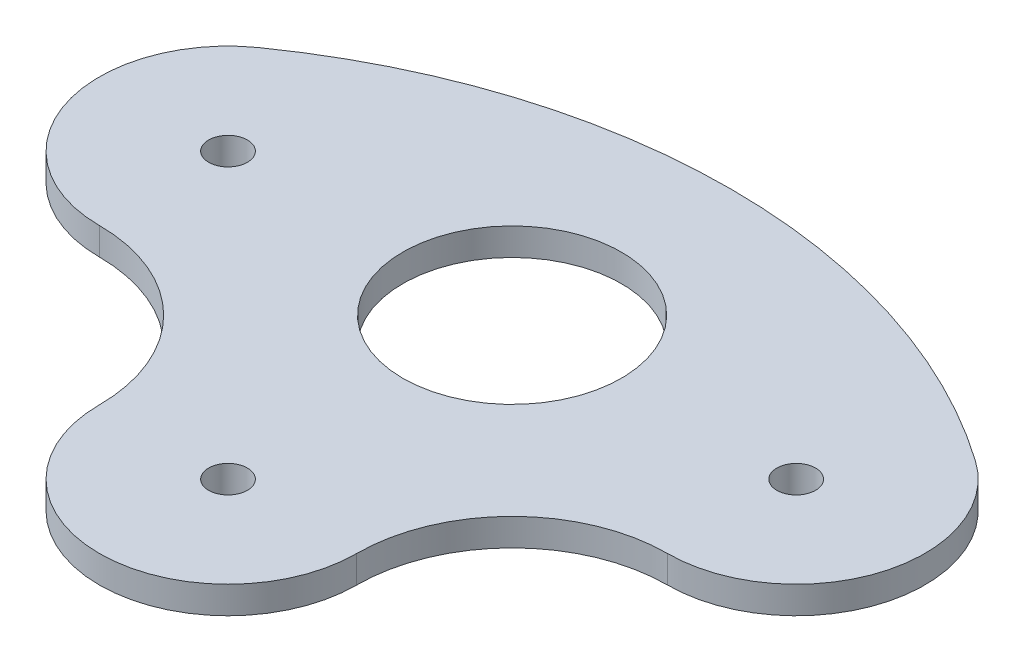
ISO-10303-21;
HEADER;
FILE_DESCRIPTION(('STEP AP214'),'2;1');
FILE_NAME('part.step','',(''),(''),'','','');
FILE_SCHEMA(('AUTOMOTIVE_DESIGN { 1 0 10303 214 1 1 1 1 }'));
ENDSEC;
DATA;
#1=APPLICATION_CONTEXT('core data for automotive mechanical design processes');
#2=APPLICATION_PROTOCOL_DEFINITION('international standard','automotive_design',2000,#1);
#3=PRODUCT_CONTEXT('',#1,'mechanical');
#4=PRODUCT('Part','Part','',(#3));
#5=PRODUCT_RELATED_PRODUCT_CATEGORY('part','',(#4));
#6=PRODUCT_DEFINITION_FORMATION('','',#4);
#7=PRODUCT_DEFINITION_CONTEXT('part definition',#1,'design');
#8=PRODUCT_DEFINITION('design','',#6,#7);
#9=PRODUCT_DEFINITION_SHAPE('','',#8);
#10=(LENGTH_UNIT() NAMED_UNIT(*) SI_UNIT(.MILLI.,.METRE.));
#11=(NAMED_UNIT(*) PLANE_ANGLE_UNIT() SI_UNIT($,.RADIAN.));
#12=(NAMED_UNIT(*) SI_UNIT($,.STERADIAN.) SOLID_ANGLE_UNIT());
#13=UNCERTAINTY_MEASURE_WITH_UNIT(LENGTH_MEASURE(1.E-05),#10,'distance_accuracy_value','');
#14=(GEOMETRIC_REPRESENTATION_CONTEXT(3) GLOBAL_UNCERTAINTY_ASSIGNED_CONTEXT((#13)) GLOBAL_UNIT_ASSIGNED_CONTEXT((#10,
#11,#12)) REPRESENTATION_CONTEXT('',''));
#15=CARTESIAN_POINT('',(0.,0.,0.));
#16=DIRECTION('',(0.,0.,1.));
#17=DIRECTION('',(1.,0.,0.));
#18=AXIS2_PLACEMENT_3D('',#15,#16,#17);
#19=CARTESIAN_POINT('',(16.5,3.175,23.4401315789474));
#20=DIRECTION('',(0.,-1.,0.));
#21=DIRECTION('',(0.,0.,-1.));
#22=AXIS2_PLACEMENT_3D('',#19,#20,#21);
#23=PLANE('',#22);
#24=CARTESIAN_POINT('',(0.,3.175,46.8802631578948));
#25=DIRECTION('',(0.,1.,0.));
#26=DIRECTION('',(0.,0.,-1.));
#27=AXIS2_PLACEMENT_3D('',#24,#25,#26);
#28=CIRCLE('',#27,72.2802631578949);
#29=CARTESIAN_POINT('',(41.6054026760919,3.175,-12.2249558192376));
#30=VERTEX_POINT('',#29);
#31=CARTESIAN_POINT('',(-41.6054026760919,3.175,-12.2249558192376));
#32=VERTEX_POINT('',#31);
#33=EDGE_CURVE('E129',#30,#32,#28,.T.);
#34=ORIENTED_EDGE('',*,*,#33,.T.);
#35=CARTESIAN_POINT('',(-33.,3.175,0.));
#36=DIRECTION('',(0.,1.,0.));
#37=DIRECTION('',(0.,0.,1.));
#38=AXIS2_PLACEMENT_3D('',#35,#36,#37);
#39=CIRCLE('',#38,14.95);
#40=CARTESIAN_POINT('',(-33.,3.175,14.95));
#41=VERTEX_POINT('',#40);
#42=EDGE_CURVE('E87',#32,#41,#39,.T.);
#43=ORIENTED_EDGE('',*,*,#42,.T.);
#44=CARTESIAN_POINT('',(-33.,3.175,33.));
#45=DIRECTION('',(0.,-1.,0.));
#46=DIRECTION('',(0.,0.,-1.));
#47=AXIS2_PLACEMENT_3D('',#44,#45,#46);
#48=CIRCLE('',#47,18.05);
#49=CARTESIAN_POINT('',(-14.95,3.175,33.));
#50=VERTEX_POINT('',#49);
#51=EDGE_CURVE('E100',#41,#50,#48,.T.);
#52=ORIENTED_EDGE('',*,*,#51,.T.);
#53=CARTESIAN_POINT('',(0.,3.175,33.));
#54=DIRECTION('',(0.,1.,0.));
#55=DIRECTION('',(0.,0.,1.));
#56=AXIS2_PLACEMENT_3D('',#53,#54,#55);
#57=CIRCLE('',#56,14.95);
#58=CARTESIAN_POINT('',(14.95,3.175,33.));
#59=VERTEX_POINT('',#58);
#60=EDGE_CURVE('E94',#50,#59,#57,.T.);
#61=ORIENTED_EDGE('',*,*,#60,.T.);
#62=CARTESIAN_POINT('',(33.,3.175,33.));
#63=DIRECTION('',(0.,-1.,0.));
#64=DIRECTION('',(0.,0.,-1.));
#65=AXIS2_PLACEMENT_3D('',#62,#63,#64);
#66=CIRCLE('',#65,18.05);
#67=CARTESIAN_POINT('',(33.,3.175,14.95));
#68=VERTEX_POINT('',#67);
#69=EDGE_CURVE('E98',#59,#68,#66,.T.);
#70=ORIENTED_EDGE('',*,*,#69,.T.);
#71=CARTESIAN_POINT('',(33.,3.175,0.));
#72=DIRECTION('',(0.,1.,0.));
#73=DIRECTION('',(0.,0.,1.));
#74=AXIS2_PLACEMENT_3D('',#71,#72,#73);
#75=CIRCLE('',#74,14.95);
#76=EDGE_CURVE('E50',#68,#30,#75,.T.);
#77=ORIENTED_EDGE('',*,*,#76,.T.);
#78=EDGE_LOOP('',(#34,#43,#52,#61,#70,#77));
#79=FACE_BOUND('',#78,.T.);
#80=CARTESIAN_POINT('',(0.,3.175,0.));
#81=DIRECTION('',(0.,1.,0.));
#82=DIRECTION('',(0.,0.,1.));
#83=AXIS2_PLACEMENT_3D('',#80,#81,#82);
#84=CIRCLE('',#83,12.7);
#85=CARTESIAN_POINT('',(0.,3.175,12.7));
#86=VERTEX_POINT('',#85);
#87=EDGE_CURVE('E122',#86,#86,#84,.T.);
#88=ORIENTED_EDGE('',*,*,#87,.F.);
#89=EDGE_LOOP('',(#88));
#90=FACE_BOUND('',#89,.T.);
#91=CARTESIAN_POINT('',(-33.,3.175,0.));
#92=DIRECTION('',(0.,1.,0.));
#93=DIRECTION('',(0.,0.,1.));
#94=AXIS2_PLACEMENT_3D('',#91,#92,#93);
#95=CIRCLE('',#94,2.25000000000001);
#96=CARTESIAN_POINT('',(-33.,3.175,2.25000000000001));
#97=VERTEX_POINT('',#96);
#98=EDGE_CURVE('E193',#97,#97,#95,.T.);
#99=ORIENTED_EDGE('',*,*,#98,.F.);
#100=EDGE_LOOP('',(#99));
#101=FACE_BOUND('',#100,.T.);
#102=CARTESIAN_POINT('',(33.,3.175,0.));
#103=DIRECTION('',(0.,1.,0.));
#104=DIRECTION('',(0.,0.,1.));
#105=AXIS2_PLACEMENT_3D('',#102,#103,#104);
#106=CIRCLE('',#105,2.25000000000001);
#107=CARTESIAN_POINT('',(33.,3.175,2.25000000000001));
#108=VERTEX_POINT('',#107);
#109=EDGE_CURVE('E187',#108,#108,#106,.T.);
#110=ORIENTED_EDGE('',*,*,#109,.F.);
#111=EDGE_LOOP('',(#110));
#112=FACE_BOUND('',#111,.T.);
#113=CARTESIAN_POINT('',(0.,3.175,33.));
#114=DIRECTION('',(0.,1.,0.));
#115=DIRECTION('',(0.,0.,1.));
#116=AXIS2_PLACEMENT_3D('',#113,#114,#115);
#117=CIRCLE('',#116,2.24999999999999);
#118=CARTESIAN_POINT('',(0.,3.175,35.25));
#119=VERTEX_POINT('',#118);
#120=EDGE_CURVE('E178',#119,#119,#117,.T.);
#121=ORIENTED_EDGE('',*,*,#120,.F.);
#122=EDGE_LOOP('',(#121));
#123=FACE_BOUND('',#122,.T.);
#124=ADVANCED_FACE('F33',(#79,#90,#101,#112,#123),#23,.F.);
#125=CARTESIAN_POINT('',(16.5,0.,23.4401315789474));
#126=DIRECTION('',(0.,-1.,0.));
#127=DIRECTION('',(0.,0.,-1.));
#128=AXIS2_PLACEMENT_3D('',#125,#126,#127);
#129=PLANE('',#128);
#130=CARTESIAN_POINT('',(33.,0.,0.));
#131=DIRECTION('',(0.,1.,0.));
#132=DIRECTION('',(0.,0.,1.));
#133=AXIS2_PLACEMENT_3D('',#130,#131,#132);
#134=CIRCLE('',#133,2.25000000000001);
#135=CARTESIAN_POINT('',(33.,0.,2.25000000000001));
#136=VERTEX_POINT('',#135);
#137=EDGE_CURVE('E184',#136,#136,#134,.T.);
#138=ORIENTED_EDGE('',*,*,#137,.T.);
#139=EDGE_LOOP('',(#138));
#140=FACE_BOUND('',#139,.T.);
#141=CARTESIAN_POINT('',(0.,0.,0.));
#142=DIRECTION('',(0.,1.,0.));
#143=DIRECTION('',(0.,0.,1.));
#144=AXIS2_PLACEMENT_3D('',#141,#142,#143);
#145=CIRCLE('',#144,12.7);
#146=CARTESIAN_POINT('',(0.,0.,12.7));
#147=VERTEX_POINT('',#146);
#148=EDGE_CURVE('E196',#147,#147,#145,.T.);
#149=ORIENTED_EDGE('',*,*,#148,.T.);
#150=EDGE_LOOP('',(#149));
#151=FACE_BOUND('',#150,.T.);
#152=CARTESIAN_POINT('',(0.,0.,46.8802631578948));
#153=DIRECTION('',(0.,1.,0.));
#154=DIRECTION('',(0.,0.,-1.));
#155=AXIS2_PLACEMENT_3D('',#152,#153,#154);
#156=CIRCLE('',#155,72.2802631578949);
#157=CARTESIAN_POINT('',(41.6054026760919,0.,-12.2249558192376));
#158=VERTEX_POINT('',#157);
#159=CARTESIAN_POINT('',(-41.6054026760919,0.,-12.2249558192376));
#160=VERTEX_POINT('',#159);
#161=EDGE_CURVE('E118',#158,#160,#156,.T.);
#162=ORIENTED_EDGE('',*,*,#161,.F.);
#163=CARTESIAN_POINT('',(33.,0.,0.));
#164=DIRECTION('',(0.,1.,0.));
#165=DIRECTION('',(0.,0.,1.));
#166=AXIS2_PLACEMENT_3D('',#163,#164,#165);
#167=CIRCLE('',#166,14.95);
#168=CARTESIAN_POINT('',(33.,0.,14.95));
#169=VERTEX_POINT('',#168);
#170=EDGE_CURVE('E79',#169,#158,#167,.T.);
#171=ORIENTED_EDGE('',*,*,#170,.F.);
#172=CARTESIAN_POINT('',(33.,0.,33.));
#173=DIRECTION('',(0.,-1.,0.));
#174=DIRECTION('',(0.,0.,-1.));
#175=AXIS2_PLACEMENT_3D('',#172,#173,#174);
#176=CIRCLE('',#175,18.05);
#177=CARTESIAN_POINT('',(14.95,0.,33.));
#178=VERTEX_POINT('',#177);
#179=EDGE_CURVE('E73',#178,#169,#176,.T.);
#180=ORIENTED_EDGE('',*,*,#179,.F.);
#181=CARTESIAN_POINT('',(0.,0.,33.));
#182=DIRECTION('',(0.,1.,0.));
#183=DIRECTION('',(0.,0.,1.));
#184=AXIS2_PLACEMENT_3D('',#181,#182,#183);
#185=CIRCLE('',#184,14.95);
#186=CARTESIAN_POINT('',(-14.95,0.,33.));
#187=VERTEX_POINT('',#186);
#188=EDGE_CURVE('E108',#187,#178,#185,.T.);
#189=ORIENTED_EDGE('',*,*,#188,.F.);
#190=CARTESIAN_POINT('',(-33.,0.,33.));
#191=DIRECTION('',(0.,-1.,0.));
#192=DIRECTION('',(0.,0.,-1.));
#193=AXIS2_PLACEMENT_3D('',#190,#191,#192);
#194=CIRCLE('',#193,18.05);
#195=CARTESIAN_POINT('',(-33.,0.,14.95));
#196=VERTEX_POINT('',#195);
#197=EDGE_CURVE('E124',#196,#187,#194,.T.);
#198=ORIENTED_EDGE('',*,*,#197,.F.);
#199=CARTESIAN_POINT('',(-33.,0.,0.));
#200=DIRECTION('',(0.,1.,0.));
#201=DIRECTION('',(0.,0.,1.));
#202=AXIS2_PLACEMENT_3D('',#199,#200,#201);
#203=CIRCLE('',#202,14.95);
#204=EDGE_CURVE('E121',#160,#196,#203,.T.);
#205=ORIENTED_EDGE('',*,*,#204,.F.);
#206=EDGE_LOOP('',(#162,#171,#180,#189,#198,#205));
#207=FACE_BOUND('',#206,.T.);
#208=CARTESIAN_POINT('',(-33.,0.,0.));
#209=DIRECTION('',(0.,1.,0.));
#210=DIRECTION('',(0.,0.,1.));
#211=AXIS2_PLACEMENT_3D('',#208,#209,#210);
#212=CIRCLE('',#211,2.25000000000001);
#213=CARTESIAN_POINT('',(-33.,0.,2.25000000000001));
#214=VERTEX_POINT('',#213);
#215=EDGE_CURVE('E190',#214,#214,#212,.T.);
#216=ORIENTED_EDGE('',*,*,#215,.T.);
#217=EDGE_LOOP('',(#216));
#218=FACE_BOUND('',#217,.T.);
#219=CARTESIAN_POINT('',(0.,0.,33.));
#220=DIRECTION('',(0.,1.,0.));
#221=DIRECTION('',(0.,0.,1.));
#222=AXIS2_PLACEMENT_3D('',#219,#220,#221);
#223=CIRCLE('',#222,2.24999999999999);
#224=CARTESIAN_POINT('',(0.,0.,35.25));
#225=VERTEX_POINT('',#224);
#226=EDGE_CURVE('E181',#225,#225,#223,.T.);
#227=ORIENTED_EDGE('',*,*,#226,.T.);
#228=EDGE_LOOP('',(#227));
#229=FACE_BOUND('',#228,.T.);
#230=ADVANCED_FACE('F138',(#140,#151,#207,#218,#229),#129,.T.);
#231=CARTESIAN_POINT('',(0.,3.175,46.8802631578948));
#232=DIRECTION('',(0.,-1.,0.));
#233=DIRECTION('',(0.,0.,-1.));
#234=AXIS2_PLACEMENT_3D('',#231,#232,#233);
#235=CYLINDRICAL_SURFACE('',#234,72.2802631578949);
#236=ORIENTED_EDGE('',*,*,#161,.T.);
#237=DIRECTION('',(0.,-1.,0.));
#238=VECTOR('',#237,1.);
#239=CARTESIAN_POINT('',(-41.6054026760919,3.175,-12.2249558192376));
#240=LINE('',#239,#238);
#241=EDGE_CURVE('E11',#32,#160,#240,.T.);
#242=ORIENTED_EDGE('',*,*,#241,.F.);
#243=ORIENTED_EDGE('',*,*,#33,.F.);
#244=DIRECTION('',(0.,-1.,0.));
#245=VECTOR('',#244,1.);
#246=CARTESIAN_POINT('',(41.6054026760919,3.175,-12.2249558192376));
#247=LINE('',#246,#245);
#248=EDGE_CURVE('E114',#30,#158,#247,.T.);
#249=ORIENTED_EDGE('',*,*,#248,.T.);
#250=EDGE_LOOP('',(#236,#242,#243,#249));
#251=FACE_BOUND('',#250,.T.);
#252=ADVANCED_FACE('F35',(#251),#235,.T.);
#253=CARTESIAN_POINT('',(-33.,3.175,0.));
#254=DIRECTION('',(0.,-1.,0.));
#255=DIRECTION('',(0.,0.,-1.));
#256=AXIS2_PLACEMENT_3D('',#253,#254,#255);
#257=CYLINDRICAL_SURFACE('',#256,14.95);
#258=ORIENTED_EDGE('',*,*,#204,.T.);
#259=DIRECTION('',(0.,-1.,0.));
#260=VECTOR('',#259,1.);
#261=CARTESIAN_POINT('',(-33.,3.175,14.95));
#262=LINE('',#261,#260);
#263=EDGE_CURVE('E42',#41,#196,#262,.T.);
#264=ORIENTED_EDGE('',*,*,#263,.F.);
#265=ORIENTED_EDGE('',*,*,#42,.F.);
#266=ORIENTED_EDGE('',*,*,#241,.T.);
#267=EDGE_LOOP('',(#258,#264,#265,#266));
#268=FACE_BOUND('',#267,.T.);
#269=ADVANCED_FACE('F256',(#268),#257,.T.);
#270=CARTESIAN_POINT('',(-33.,3.175,33.));
#271=DIRECTION('',(0.,-1.,0.));
#272=DIRECTION('',(0.,0.,-1.));
#273=AXIS2_PLACEMENT_3D('',#270,#271,#272);
#274=CYLINDRICAL_SURFACE('',#273,18.05);
#275=ORIENTED_EDGE('',*,*,#197,.T.);
#276=DIRECTION('',(0.,-1.,0.));
#277=VECTOR('',#276,1.);
#278=CARTESIAN_POINT('',(-14.95,3.175,33.));
#279=LINE('',#278,#277);
#280=EDGE_CURVE('E109',#50,#187,#279,.T.);
#281=ORIENTED_EDGE('',*,*,#280,.F.);
#282=ORIENTED_EDGE('',*,*,#51,.F.);
#283=ORIENTED_EDGE('',*,*,#263,.T.);
#284=EDGE_LOOP('',(#275,#281,#282,#283));
#285=FACE_BOUND('',#284,.T.);
#286=ADVANCED_FACE('F135',(#285),#274,.F.);
#287=CARTESIAN_POINT('',(0.,3.175,33.));
#288=DIRECTION('',(0.,-1.,0.));
#289=DIRECTION('',(0.,0.,-1.));
#290=AXIS2_PLACEMENT_3D('',#287,#288,#289);
#291=CYLINDRICAL_SURFACE('',#290,14.95);
#292=ORIENTED_EDGE('',*,*,#188,.T.);
#293=DIRECTION('',(0.,-1.,0.));
#294=VECTOR('',#293,1.);
#295=CARTESIAN_POINT('',(14.95,3.175,33.));
#296=LINE('',#295,#294);
#297=EDGE_CURVE('E105',#59,#178,#296,.T.);
#298=ORIENTED_EDGE('',*,*,#297,.F.);
#299=ORIENTED_EDGE('',*,*,#60,.F.);
#300=ORIENTED_EDGE('',*,*,#280,.T.);
#301=EDGE_LOOP('',(#292,#298,#299,#300));
#302=FACE_BOUND('',#301,.T.);
#303=ADVANCED_FACE('F106',(#302),#291,.T.);
#304=CARTESIAN_POINT('',(33.,3.175,33.));
#305=DIRECTION('',(0.,-1.,0.));
#306=DIRECTION('',(0.,0.,-1.));
#307=AXIS2_PLACEMENT_3D('',#304,#305,#306);
#308=CYLINDRICAL_SURFACE('',#307,18.05);
#309=ORIENTED_EDGE('',*,*,#179,.T.);
#310=DIRECTION('',(0.,-1.,0.));
#311=VECTOR('',#310,1.);
#312=CARTESIAN_POINT('',(33.,3.175,14.95));
#313=LINE('',#312,#311);
#314=EDGE_CURVE('E110',#68,#169,#313,.T.);
#315=ORIENTED_EDGE('',*,*,#314,.F.);
#316=ORIENTED_EDGE('',*,*,#69,.F.);
#317=ORIENTED_EDGE('',*,*,#297,.T.);
#318=EDGE_LOOP('',(#309,#315,#316,#317));
#319=FACE_BOUND('',#318,.T.);
#320=ADVANCED_FACE('F112',(#319),#308,.F.);
#321=CARTESIAN_POINT('',(33.,3.175,0.));
#322=DIRECTION('',(0.,-1.,0.));
#323=DIRECTION('',(0.,0.,-1.));
#324=AXIS2_PLACEMENT_3D('',#321,#322,#323);
#325=CYLINDRICAL_SURFACE('',#324,14.95);
#326=ORIENTED_EDGE('',*,*,#170,.T.);
#327=ORIENTED_EDGE('',*,*,#248,.F.);
#328=ORIENTED_EDGE('',*,*,#76,.F.);
#329=ORIENTED_EDGE('',*,*,#314,.T.);
#330=EDGE_LOOP('',(#326,#327,#328,#329));
#331=FACE_BOUND('',#330,.T.);
#332=ADVANCED_FACE('F143',(#331),#325,.T.);
#333=CARTESIAN_POINT('',(0.,3.175,0.));
#334=DIRECTION('',(0.,-1.,0.));
#335=DIRECTION('',(0.,0.,-1.));
#336=AXIS2_PLACEMENT_3D('',#333,#334,#335);
#337=CYLINDRICAL_SURFACE('',#336,12.7);
#338=ORIENTED_EDGE('',*,*,#87,.T.);
#339=EDGE_LOOP('',(#338));
#340=FACE_BOUND('',#339,.T.);
#341=ORIENTED_EDGE('',*,*,#148,.F.);
#342=EDGE_LOOP('',(#341));
#343=FACE_BOUND('',#342,.T.);
#344=ADVANCED_FACE('F145',(#340,#343),#337,.F.);
#345=CARTESIAN_POINT('',(-33.,3.175,0.));
#346=DIRECTION('',(0.,-1.,0.));
#347=DIRECTION('',(0.,0.,-1.));
#348=AXIS2_PLACEMENT_3D('',#345,#346,#347);
#349=CYLINDRICAL_SURFACE('',#348,2.25000000000001);
#350=ORIENTED_EDGE('',*,*,#98,.T.);
#351=EDGE_LOOP('',(#350));
#352=FACE_BOUND('',#351,.T.);
#353=ORIENTED_EDGE('',*,*,#215,.F.);
#354=EDGE_LOOP('',(#353));
#355=FACE_BOUND('',#354,.T.);
#356=ADVANCED_FACE('F151',(#352,#355),#349,.F.);
#357=CARTESIAN_POINT('',(33.,3.175,0.));
#358=DIRECTION('',(0.,-1.,0.));
#359=DIRECTION('',(0.,0.,-1.));
#360=AXIS2_PLACEMENT_3D('',#357,#358,#359);
#361=CYLINDRICAL_SURFACE('',#360,2.25000000000001);
#362=ORIENTED_EDGE('',*,*,#109,.T.);
#363=EDGE_LOOP('',(#362));
#364=FACE_BOUND('',#363,.T.);
#365=ORIENTED_EDGE('',*,*,#137,.F.);
#366=EDGE_LOOP('',(#365));
#367=FACE_BOUND('',#366,.T.);
#368=ADVANCED_FACE('F165',(#364,#367),#361,.F.);
#369=CARTESIAN_POINT('',(0.,3.175,33.));
#370=DIRECTION('',(0.,-1.,0.));
#371=DIRECTION('',(0.,0.,-1.));
#372=AXIS2_PLACEMENT_3D('',#369,#370,#371);
#373=CYLINDRICAL_SURFACE('',#372,2.24999999999999);
#374=ORIENTED_EDGE('',*,*,#120,.T.);
#375=EDGE_LOOP('',(#374));
#376=FACE_BOUND('',#375,.T.);
#377=ORIENTED_EDGE('',*,*,#226,.F.);
#378=EDGE_LOOP('',(#377));
#379=FACE_BOUND('',#378,.T.);
#380=ADVANCED_FACE('F169',(#376,#379),#373,.F.);
#381=CLOSED_SHELL('',(#124,#230,#252,#269,#286,#303,#320,#332,#344,#356,#368,#380));
#382=MANIFOLD_SOLID_BREP('B2',#381);
#383=ADVANCED_BREP_SHAPE_REPRESENTATION('',(#18,#382),#14);
#384=SHAPE_DEFINITION_REPRESENTATION(#9,#383);
ENDSEC;
END-ISO-10303-21;
